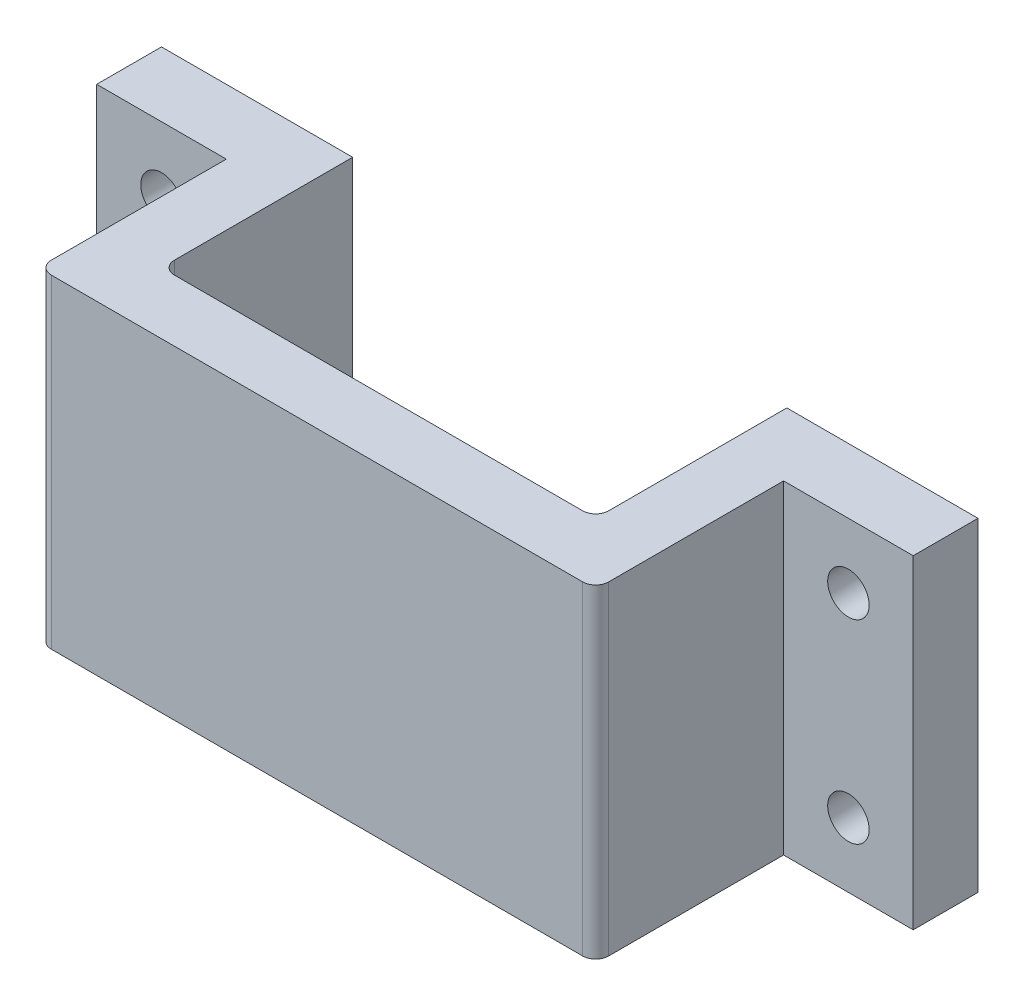
ISO-10303-21;
HEADER;
FILE_DESCRIPTION(('STEP AP214'),'2;1');
FILE_NAME('part.step','',(''),(''),'','','');
FILE_SCHEMA(('AUTOMOTIVE_DESIGN { 1 0 10303 214 1 1 1 1 }'));
ENDSEC;
DATA;
#1=APPLICATION_CONTEXT('core data for automotive mechanical design processes');
#2=APPLICATION_PROTOCOL_DEFINITION('international standard','automotive_design',2000,#1);
#3=PRODUCT_CONTEXT('',#1,'mechanical');
#4=PRODUCT('Part','Part','',(#3));
#5=PRODUCT_RELATED_PRODUCT_CATEGORY('part','',(#4));
#6=PRODUCT_DEFINITION_FORMATION('','',#4);
#7=PRODUCT_DEFINITION_CONTEXT('part definition',#1,'design');
#8=PRODUCT_DEFINITION('design','',#6,#7);
#9=PRODUCT_DEFINITION_SHAPE('','',#8);
#10=(LENGTH_UNIT() NAMED_UNIT(*) SI_UNIT(.MILLI.,.METRE.));
#11=(NAMED_UNIT(*) PLANE_ANGLE_UNIT() SI_UNIT($,.RADIAN.));
#12=(NAMED_UNIT(*) SI_UNIT($,.STERADIAN.) SOLID_ANGLE_UNIT());
#13=UNCERTAINTY_MEASURE_WITH_UNIT(LENGTH_MEASURE(1.E-05),#10,'distance_accuracy_value','');
#14=(GEOMETRIC_REPRESENTATION_CONTEXT(3) GLOBAL_UNCERTAINTY_ASSIGNED_CONTEXT((#13)) GLOBAL_UNIT_ASSIGNED_CONTEXT((#10,
#11,#12)) REPRESENTATION_CONTEXT('',''));
#15=CARTESIAN_POINT('',(0.,0.,0.));
#16=DIRECTION('',(0.,0.,1.));
#17=DIRECTION('',(1.,0.,0.));
#18=AXIS2_PLACEMENT_3D('',#15,#16,#17);
#19=CARTESIAN_POINT('',(0.,25.,0.));
#20=DIRECTION('',(1.,0.,0.));
#21=DIRECTION('',(0.,0.,-1.));
#22=AXIS2_PLACEMENT_3D('',#19,#20,#21);
#23=PLANE('',#22);
#24=DIRECTION('',(0.,0.,1.));
#25=VECTOR('',#24,1.);
#26=CARTESIAN_POINT('',(0.,0.,0.));
#27=LINE('',#26,#25);
#28=CARTESIAN_POINT('',(0.,0.,-14.5));
#29=VERTEX_POINT('',#28);
#30=CARTESIAN_POINT('',(0.,0.,-1.));
#31=VERTEX_POINT('',#30);
#32=EDGE_CURVE('E177',#29,#31,#27,.T.);
#33=ORIENTED_EDGE('',*,*,#32,.T.);
#34=DIRECTION('',(0.,-1.,0.));
#35=VECTOR('',#34,1.);
#36=CARTESIAN_POINT('',(0.,25.,-1.));
#37=LINE('',#36,#35);
#38=CARTESIAN_POINT('',(0.,25.,-1.));
#39=VERTEX_POINT('',#38);
#40=EDGE_CURVE('E58',#31,#39,#37,.F.);
#41=ORIENTED_EDGE('',*,*,#40,.T.);
#42=DIRECTION('',(0.,0.,1.));
#43=VECTOR('',#42,1.);
#44=CARTESIAN_POINT('',(0.,25.,0.));
#45=LINE('',#44,#43);
#46=CARTESIAN_POINT('',(0.,25.,-14.5));
#47=VERTEX_POINT('',#46);
#48=EDGE_CURVE('E162',#47,#39,#45,.T.);
#49=ORIENTED_EDGE('',*,*,#48,.F.);
#50=DIRECTION('',(0.,-1.,0.));
#51=VECTOR('',#50,1.);
#52=CARTESIAN_POINT('',(0.,25.,-14.5));
#53=LINE('',#52,#51);
#54=EDGE_CURVE('E151',#47,#29,#53,.T.);
#55=ORIENTED_EDGE('',*,*,#54,.T.);
#56=EDGE_LOOP('',(#33,#41,#49,#55));
#57=FACE_BOUND('',#56,.T.);
#58=ADVANCED_FACE('F35',(#57),#23,.F.);
#59=CARTESIAN_POINT('',(0.,25.,0.));
#60=DIRECTION('',(0.,0.,-1.));
#61=DIRECTION('',(-1.,0.,0.));
#62=AXIS2_PLACEMENT_3D('',#59,#60,#61);
#63=PLANE('',#62);
#64=DIRECTION('',(1.,0.,0.));
#65=VECTOR('',#64,1.);
#66=CARTESIAN_POINT('',(0.,25.,0.));
#67=LINE('',#66,#65);
#68=CARTESIAN_POINT('',(1.,25.,0.));
#69=VERTEX_POINT('',#68);
#70=CARTESIAN_POINT('',(42.,25.,0.));
#71=VERTEX_POINT('',#70);
#72=EDGE_CURVE('E168',#69,#71,#67,.T.);
#73=ORIENTED_EDGE('',*,*,#72,.F.);
#74=DIRECTION('',(0.,-1.,0.));
#75=VECTOR('',#74,1.);
#76=CARTESIAN_POINT('',(1.,25.,0.));
#77=LINE('',#76,#75);
#78=CARTESIAN_POINT('',(1.,0.,0.));
#79=VERTEX_POINT('',#78);
#80=EDGE_CURVE('E202',#69,#79,#77,.T.);
#81=ORIENTED_EDGE('',*,*,#80,.T.);
#82=DIRECTION('',(1.,0.,0.));
#83=VECTOR('',#82,1.);
#84=CARTESIAN_POINT('',(0.,0.,0.));
#85=LINE('',#84,#83);
#86=CARTESIAN_POINT('',(42.,0.,0.));
#87=VERTEX_POINT('',#86);
#88=EDGE_CURVE('E218',#79,#87,#85,.T.);
#89=ORIENTED_EDGE('',*,*,#88,.T.);
#90=DIRECTION('',(0.,-1.,0.));
#91=VECTOR('',#90,1.);
#92=CARTESIAN_POINT('',(42.,25.,0.));
#93=LINE('',#92,#91);
#94=EDGE_CURVE('E205',#87,#71,#93,.F.);
#95=ORIENTED_EDGE('',*,*,#94,.T.);
#96=EDGE_LOOP('',(#73,#81,#89,#95));
#97=FACE_BOUND('',#96,.T.);
#98=ADVANCED_FACE('F200',(#97),#63,.F.);
#99=CARTESIAN_POINT('',(43.,25.,0.));
#100=DIRECTION('',(-1.,0.,0.));
#101=DIRECTION('',(0.,0.,1.));
#102=AXIS2_PLACEMENT_3D('',#99,#100,#101);
#103=PLANE('',#102);
#104=DIRECTION('',(0.,0.,-1.));
#105=VECTOR('',#104,1.);
#106=CARTESIAN_POINT('',(43.,25.,0.));
#107=LINE('',#106,#105);
#108=CARTESIAN_POINT('',(43.,25.,-1.00000000000001));
#109=VERTEX_POINT('',#108);
#110=CARTESIAN_POINT('',(43.,25.,-14.5));
#111=VERTEX_POINT('',#110);
#112=EDGE_CURVE('E171',#109,#111,#107,.T.);
#113=ORIENTED_EDGE('',*,*,#112,.F.);
#114=DIRECTION('',(0.,-1.,0.));
#115=VECTOR('',#114,1.);
#116=CARTESIAN_POINT('',(43.,25.,-1.00000000000001));
#117=LINE('',#116,#115);
#118=CARTESIAN_POINT('',(43.,0.,-1.00000000000001));
#119=VERTEX_POINT('',#118);
#120=EDGE_CURVE('E11',#109,#119,#117,.T.);
#121=ORIENTED_EDGE('',*,*,#120,.T.);
#122=DIRECTION('',(0.,0.,-1.));
#123=VECTOR('',#122,1.);
#124=CARTESIAN_POINT('',(43.,0.,0.));
#125=LINE('',#124,#123);
#126=CARTESIAN_POINT('',(43.,0.,-14.5));
#127=VERTEX_POINT('',#126);
#128=EDGE_CURVE('E215',#119,#127,#125,.T.);
#129=ORIENTED_EDGE('',*,*,#128,.T.);
#130=DIRECTION('',(0.,1.,0.));
#131=VECTOR('',#130,1.);
#132=CARTESIAN_POINT('',(43.,25.,-14.5));
#133=LINE('',#132,#131);
#134=EDGE_CURVE('E238',#127,#111,#133,.T.);
#135=ORIENTED_EDGE('',*,*,#134,.T.);
#136=EDGE_LOOP('',(#113,#121,#129,#135));
#137=FACE_BOUND('',#136,.T.);
#138=ADVANCED_FACE('F365',(#137),#103,.F.);
#139=CARTESIAN_POINT('',(43.,25.,-19.5));
#140=DIRECTION('',(0.,0.,1.));
#141=DIRECTION('',(1.,0.,0.));
#142=AXIS2_PLACEMENT_3D('',#139,#140,#141);
#143=PLANE('',#142);
#144=CARTESIAN_POINT('',(48.,5.00000000000001,-19.4999999999999));
#145=DIRECTION('',(0.,0.,-1.));
#146=DIRECTION('',(-1.,0.,0.));
#147=AXIS2_PLACEMENT_3D('',#144,#145,#146);
#148=CIRCLE('',#147,1.60000000000005);
#149=CARTESIAN_POINT('',(46.3999999999999,5.00000000000001,-19.4999999999999));
#150=VERTEX_POINT('',#149);
#151=EDGE_CURVE('E327',#150,#150,#148,.T.);
#152=ORIENTED_EDGE('',*,*,#151,.F.);
#153=EDGE_LOOP('',(#152));
#154=FACE_BOUND('',#153,.T.);
#155=CARTESIAN_POINT('',(48.,20.,-19.4999999999999));
#156=DIRECTION('',(0.,0.,-1.));
#157=DIRECTION('',(-1.,0.,0.));
#158=AXIS2_PLACEMENT_3D('',#155,#156,#157);
#159=CIRCLE('',#158,1.60000000000005);
#160=CARTESIAN_POINT('',(46.3999999999999,20.,-19.4999999999999));
#161=VERTEX_POINT('',#160);
#162=EDGE_CURVE('E324',#161,#161,#159,.T.);
#163=ORIENTED_EDGE('',*,*,#162,.F.);
#164=EDGE_LOOP('',(#163));
#165=FACE_BOUND('',#164,.T.);
#166=DIRECTION('',(-1.,0.,0.));
#167=VECTOR('',#166,1.);
#168=CARTESIAN_POINT('',(43.,0.,-19.5));
#169=LINE('',#168,#167);
#170=CARTESIAN_POINT('',(53.,0.,-19.5));
#171=VERTEX_POINT('',#170);
#172=CARTESIAN_POINT('',(38.25,0.,-19.5));
#173=VERTEX_POINT('',#172);
#174=EDGE_CURVE('E217',#171,#173,#169,.T.);
#175=ORIENTED_EDGE('',*,*,#174,.T.);
#176=DIRECTION('',(0.,-1.,0.));
#177=VECTOR('',#176,1.);
#178=CARTESIAN_POINT('',(38.25,25.,-19.5));
#179=LINE('',#178,#177);
#180=CARTESIAN_POINT('',(38.25,25.,-19.5));
#181=VERTEX_POINT('',#180);
#182=EDGE_CURVE('E233',#181,#173,#179,.T.);
#183=ORIENTED_EDGE('',*,*,#182,.F.);
#184=DIRECTION('',(-1.,0.,0.));
#185=VECTOR('',#184,1.);
#186=CARTESIAN_POINT('',(43.,25.,-19.5));
#187=LINE('',#186,#185);
#188=CARTESIAN_POINT('',(53.,25.,-19.5));
#189=VERTEX_POINT('',#188);
#190=EDGE_CURVE('E189',#189,#181,#187,.T.);
#191=ORIENTED_EDGE('',*,*,#190,.F.);
#192=DIRECTION('',(0.,-1.,0.));
#193=VECTOR('',#192,1.);
#194=CARTESIAN_POINT('',(53.,25.,-19.5));
#195=LINE('',#194,#193);
#196=EDGE_CURVE('E250',#189,#171,#195,.T.);
#197=ORIENTED_EDGE('',*,*,#196,.T.);
#198=EDGE_LOOP('',(#175,#183,#191,#197));
#199=FACE_BOUND('',#198,.T.);
#200=ADVANCED_FACE('F265',(#154,#165,#199),#143,.F.);
#201=CARTESIAN_POINT('',(38.25,25.,-19.5));
#202=DIRECTION('',(1.,0.,0.));
#203=DIRECTION('',(0.,0.,-1.));
#204=AXIS2_PLACEMENT_3D('',#201,#202,#203);
#205=PLANE('',#204);
#206=DIRECTION('',(0.,0.,1.));
#207=VECTOR('',#206,1.);
#208=CARTESIAN_POINT('',(38.25,0.,-19.5));
#209=LINE('',#208,#207);
#210=CARTESIAN_POINT('',(38.25,0.,-5.75000000000001));
#211=VERTEX_POINT('',#210);
#212=EDGE_CURVE('E223',#173,#211,#209,.T.);
#213=ORIENTED_EDGE('',*,*,#212,.T.);
#214=DIRECTION('',(0.,-1.,0.));
#215=VECTOR('',#214,1.);
#216=CARTESIAN_POINT('',(38.25,25.,-5.75000000000001));
#217=LINE('',#216,#215);
#218=CARTESIAN_POINT('',(38.25,25.,-5.75000000000001));
#219=VERTEX_POINT('',#218);
#220=EDGE_CURVE('E306',#211,#219,#217,.F.);
#221=ORIENTED_EDGE('',*,*,#220,.T.);
#222=DIRECTION('',(0.,0.,1.));
#223=VECTOR('',#222,1.);
#224=CARTESIAN_POINT('',(38.25,25.,-19.5));
#225=LINE('',#224,#223);
#226=EDGE_CURVE('E267',#181,#219,#225,.T.);
#227=ORIENTED_EDGE('',*,*,#226,.F.);
#228=ORIENTED_EDGE('',*,*,#182,.T.);
#229=EDGE_LOOP('',(#213,#221,#227,#228));
#230=FACE_BOUND('',#229,.T.);
#231=ADVANCED_FACE('F425',(#230),#205,.F.);
#232=CARTESIAN_POINT('',(4.75,25.,-4.75));
#233=DIRECTION('',(0.,0.,1.));
#234=DIRECTION('',(1.,0.,0.));
#235=AXIS2_PLACEMENT_3D('',#232,#233,#234);
#236=PLANE('',#235);
#237=DIRECTION('',(-1.,0.,0.));
#238=VECTOR('',#237,1.);
#239=CARTESIAN_POINT('',(4.75,25.,-4.75));
#240=LINE('',#239,#238);
#241=CARTESIAN_POINT('',(37.25,25.,-4.75000000000001));
#242=VERTEX_POINT('',#241);
#243=CARTESIAN_POINT('',(5.75,25.,-4.75));
#244=VERTEX_POINT('',#243);
#245=EDGE_CURVE('E268',#242,#244,#240,.T.);
#246=ORIENTED_EDGE('',*,*,#245,.F.);
#247=DIRECTION('',(0.,-1.,0.));
#248=VECTOR('',#247,1.);
#249=CARTESIAN_POINT('',(37.25,0.,-4.75000000000001));
#250=LINE('',#249,#248);
#251=CARTESIAN_POINT('',(37.25,0.,-4.75000000000001));
#252=VERTEX_POINT('',#251);
#253=EDGE_CURVE('E303',#242,#252,#250,.T.);
#254=ORIENTED_EDGE('',*,*,#253,.T.);
#255=DIRECTION('',(-1.,0.,0.));
#256=VECTOR('',#255,1.);
#257=CARTESIAN_POINT('',(4.75,0.,-4.75));
#258=LINE('',#257,#256);
#259=CARTESIAN_POINT('',(5.75,0.,-4.75));
#260=VERTEX_POINT('',#259);
#261=EDGE_CURVE('E226',#252,#260,#258,.T.);
#262=ORIENTED_EDGE('',*,*,#261,.T.);
#263=DIRECTION('',(0.,-1.,0.));
#264=VECTOR('',#263,1.);
#265=CARTESIAN_POINT('',(5.75,25.,-4.75));
#266=LINE('',#265,#264);
#267=EDGE_CURVE('E237',#260,#244,#266,.F.);
#268=ORIENTED_EDGE('',*,*,#267,.T.);
#269=EDGE_LOOP('',(#246,#254,#262,#268));
#270=FACE_BOUND('',#269,.T.);
#271=ADVANCED_FACE('F355',(#270),#236,.F.);
#272=CARTESIAN_POINT('',(4.74999999999999,25.,-19.5));
#273=DIRECTION('',(-1.,0.,0.));
#274=DIRECTION('',(0.,0.,1.));
#275=AXIS2_PLACEMENT_3D('',#272,#273,#274);
#276=PLANE('',#275);
#277=DIRECTION('',(0.,0.,-1.));
#278=VECTOR('',#277,1.);
#279=CARTESIAN_POINT('',(4.74999999999999,25.,-19.5));
#280=LINE('',#279,#278);
#281=CARTESIAN_POINT('',(4.75,25.,-5.75));
#282=VERTEX_POINT('',#281);
#283=CARTESIAN_POINT('',(4.74999999999999,25.,-19.5));
#284=VERTEX_POINT('',#283);
#285=EDGE_CURVE('E271',#282,#284,#280,.T.);
#286=ORIENTED_EDGE('',*,*,#285,.F.);
#287=DIRECTION('',(0.,-1.,0.));
#288=VECTOR('',#287,1.);
#289=CARTESIAN_POINT('',(4.75,0.,-5.75));
#290=LINE('',#289,#288);
#291=CARTESIAN_POINT('',(4.75,0.,-5.75));
#292=VERTEX_POINT('',#291);
#293=EDGE_CURVE('E308',#282,#292,#290,.T.);
#294=ORIENTED_EDGE('',*,*,#293,.T.);
#295=DIRECTION('',(0.,0.,-1.));
#296=VECTOR('',#295,1.);
#297=CARTESIAN_POINT('',(4.74999999999999,0.,-19.5));
#298=LINE('',#297,#296);
#299=CARTESIAN_POINT('',(4.74999999999999,0.,-19.5));
#300=VERTEX_POINT('',#299);
#301=EDGE_CURVE('E173',#292,#300,#298,.T.);
#302=ORIENTED_EDGE('',*,*,#301,.T.);
#303=DIRECTION('',(0.,-1.,0.));
#304=VECTOR('',#303,1.);
#305=CARTESIAN_POINT('',(4.74999999999999,25.,-19.5));
#306=LINE('',#305,#304);
#307=EDGE_CURVE('E230',#284,#300,#306,.T.);
#308=ORIENTED_EDGE('',*,*,#307,.F.);
#309=EDGE_LOOP('',(#286,#294,#302,#308));
#310=FACE_BOUND('',#309,.T.);
#311=ADVANCED_FACE('F346',(#310),#276,.F.);
#312=CARTESIAN_POINT('',(4.74999999999999,25.,-19.5));
#313=DIRECTION('',(0.,0.,1.));
#314=DIRECTION('',(1.,0.,0.));
#315=AXIS2_PLACEMENT_3D('',#312,#313,#314);
#316=PLANE('',#315);
#317=CARTESIAN_POINT('',(-5.00000000000003,5.00000000000001,-19.5));
#318=DIRECTION('',(0.,0.,-1.));
#319=DIRECTION('',(-1.,0.,0.));
#320=AXIS2_PLACEMENT_3D('',#317,#318,#319);
#321=CIRCLE('',#320,1.60000000000003);
#322=CARTESIAN_POINT('',(-6.60000000000006,5.00000000000001,-19.5));
#323=VERTEX_POINT('',#322);
#324=EDGE_CURVE('E321',#323,#323,#321,.T.);
#325=ORIENTED_EDGE('',*,*,#324,.F.);
#326=EDGE_LOOP('',(#325));
#327=FACE_BOUND('',#326,.T.);
#328=CARTESIAN_POINT('',(-5.00000000000002,20.,-19.5));
#329=DIRECTION('',(0.,0.,-1.));
#330=DIRECTION('',(-1.,0.,0.));
#331=AXIS2_PLACEMENT_3D('',#328,#329,#330);
#332=CIRCLE('',#331,1.60000000000003);
#333=CARTESIAN_POINT('',(-6.60000000000006,20.,-19.5));
#334=VERTEX_POINT('',#333);
#335=EDGE_CURVE('E293',#334,#334,#332,.T.);
#336=ORIENTED_EDGE('',*,*,#335,.F.);
#337=EDGE_LOOP('',(#336));
#338=FACE_BOUND('',#337,.T.);
#339=DIRECTION('',(-1.,0.,0.));
#340=VECTOR('',#339,1.);
#341=CARTESIAN_POINT('',(4.74999999999999,0.,-19.5));
#342=LINE('',#341,#340);
#343=CARTESIAN_POINT('',(-10.,0.,-19.5));
#344=VERTEX_POINT('',#343);
#345=EDGE_CURVE('E169',#300,#344,#342,.T.);
#346=ORIENTED_EDGE('',*,*,#345,.T.);
#347=DIRECTION('',(0.,1.,0.));
#348=VECTOR('',#347,1.);
#349=CARTESIAN_POINT('',(-10.,25.,-19.5));
#350=LINE('',#349,#348);
#351=CARTESIAN_POINT('',(-10.,25.,-19.5));
#352=VERTEX_POINT('',#351);
#353=EDGE_CURVE('E166',#344,#352,#350,.T.);
#354=ORIENTED_EDGE('',*,*,#353,.T.);
#355=DIRECTION('',(-1.,0.,0.));
#356=VECTOR('',#355,1.);
#357=CARTESIAN_POINT('',(4.74999999999999,25.,-19.5));
#358=LINE('',#357,#356);
#359=EDGE_CURVE('E234',#284,#352,#358,.T.);
#360=ORIENTED_EDGE('',*,*,#359,.F.);
#361=ORIENTED_EDGE('',*,*,#307,.T.);
#362=EDGE_LOOP('',(#346,#354,#360,#361));
#363=FACE_BOUND('',#362,.T.);
#364=ADVANCED_FACE('F287',(#327,#338,#363),#316,.F.);
#365=CARTESIAN_POINT('',(0.,25.,0.));
#366=DIRECTION('',(0.,1.,0.));
#367=DIRECTION('',(0.,0.,1.));
#368=AXIS2_PLACEMENT_3D('',#365,#366,#367);
#369=PLANE('',#368);
#370=ORIENTED_EDGE('',*,*,#48,.T.);
#371=CARTESIAN_POINT('',(1.,25.,-1.));
#372=DIRECTION('',(0.,1.,0.));
#373=DIRECTION('',(0.,0.,1.));
#374=AXIS2_PLACEMENT_3D('',#371,#372,#373);
#375=CIRCLE('',#374,1.);
#376=EDGE_CURVE('E43',#39,#69,#375,.T.);
#377=ORIENTED_EDGE('',*,*,#376,.T.);
#378=ORIENTED_EDGE('',*,*,#72,.T.);
#379=CARTESIAN_POINT('',(42.,25.,-1.00000000000001));
#380=DIRECTION('',(0.,1.,0.));
#381=DIRECTION('',(0.,0.,1.));
#382=AXIS2_PLACEMENT_3D('',#379,#380,#381);
#383=CIRCLE('',#382,1.);
#384=EDGE_CURVE('E50',#71,#109,#383,.T.);
#385=ORIENTED_EDGE('',*,*,#384,.T.);
#386=ORIENTED_EDGE('',*,*,#112,.T.);
#387=DIRECTION('',(1.,0.,0.));
#388=VECTOR('',#387,1.);
#389=CARTESIAN_POINT('',(43.,25.,-14.5));
#390=LINE('',#389,#388);
#391=CARTESIAN_POINT('',(53.,25.,-14.5));
#392=VERTEX_POINT('',#391);
#393=EDGE_CURVE('E243',#111,#392,#390,.T.);
#394=ORIENTED_EDGE('',*,*,#393,.T.);
#395=DIRECTION('',(0.,0.,-1.));
#396=VECTOR('',#395,1.);
#397=CARTESIAN_POINT('',(53.,25.,-14.5));
#398=LINE('',#397,#396);
#399=EDGE_CURVE('E184',#392,#189,#398,.T.);
#400=ORIENTED_EDGE('',*,*,#399,.T.);
#401=ORIENTED_EDGE('',*,*,#190,.T.);
#402=ORIENTED_EDGE('',*,*,#226,.T.);
#403=CARTESIAN_POINT('',(37.25,25.,-5.75000000000001));
#404=DIRECTION('',(0.,1.,0.));
#405=DIRECTION('',(0.,0.,1.));
#406=AXIS2_PLACEMENT_3D('',#403,#404,#405);
#407=CIRCLE('',#406,1.);
#408=EDGE_CURVE('E313',#219,#242,#407,.F.);
#409=ORIENTED_EDGE('',*,*,#408,.T.);
#410=ORIENTED_EDGE('',*,*,#245,.T.);
#411=CARTESIAN_POINT('',(5.75,25.,-5.75));
#412=DIRECTION('',(0.,1.,0.));
#413=DIRECTION('',(0.,0.,1.));
#414=AXIS2_PLACEMENT_3D('',#411,#412,#413);
#415=CIRCLE('',#414,1.);
#416=EDGE_CURVE('E211',#244,#282,#415,.F.);
#417=ORIENTED_EDGE('',*,*,#416,.T.);
#418=ORIENTED_EDGE('',*,*,#285,.T.);
#419=ORIENTED_EDGE('',*,*,#359,.T.);
#420=DIRECTION('',(0.,0.,-1.));
#421=VECTOR('',#420,1.);
#422=CARTESIAN_POINT('',(-10.,25.,-14.5));
#423=LINE('',#422,#421);
#424=CARTESIAN_POINT('',(-10.,25.,-14.5));
#425=VERTEX_POINT('',#424);
#426=EDGE_CURVE('E165',#425,#352,#423,.T.);
#427=ORIENTED_EDGE('',*,*,#426,.F.);
#428=DIRECTION('',(1.,0.,0.));
#429=VECTOR('',#428,1.);
#430=CARTESIAN_POINT('',(0.,25.,-14.5));
#431=LINE('',#430,#429);
#432=EDGE_CURVE('E155',#425,#47,#431,.T.);
#433=ORIENTED_EDGE('',*,*,#432,.T.);
#434=EDGE_LOOP('',(#370,#377,#378,#385,#386,#394,#400,#401,#402,#409,#410,#417,#418,#419,#427,#433));
#435=FACE_BOUND('',#434,.T.);
#436=ADVANCED_FACE('F161',(#435),#369,.T.);
#437=CARTESIAN_POINT('',(0.,0.,0.));
#438=DIRECTION('',(0.,1.,0.));
#439=DIRECTION('',(0.,0.,1.));
#440=AXIS2_PLACEMENT_3D('',#437,#438,#439);
#441=PLANE('',#440);
#442=ORIENTED_EDGE('',*,*,#88,.F.);
#443=CARTESIAN_POINT('',(1.,0.,-1.));
#444=DIRECTION('',(0.,1.,0.));
#445=DIRECTION('',(0.,0.,1.));
#446=AXIS2_PLACEMENT_3D('',#443,#444,#445);
#447=CIRCLE('',#446,1.);
#448=EDGE_CURVE('E207',#79,#31,#447,.F.);
#449=ORIENTED_EDGE('',*,*,#448,.T.);
#450=ORIENTED_EDGE('',*,*,#32,.F.);
#451=DIRECTION('',(-1.,0.,0.));
#452=VECTOR('',#451,1.);
#453=CARTESIAN_POINT('',(0.,0.,-14.5));
#454=LINE('',#453,#452);
#455=CARTESIAN_POINT('',(-10.,0.,-14.5));
#456=VERTEX_POINT('',#455);
#457=EDGE_CURVE('E158',#29,#456,#454,.T.);
#458=ORIENTED_EDGE('',*,*,#457,.T.);
#459=DIRECTION('',(0.,0.,-1.));
#460=VECTOR('',#459,1.);
#461=CARTESIAN_POINT('',(-10.,0.,-14.5));
#462=LINE('',#461,#460);
#463=EDGE_CURVE('E285',#456,#344,#462,.T.);
#464=ORIENTED_EDGE('',*,*,#463,.T.);
#465=ORIENTED_EDGE('',*,*,#345,.F.);
#466=ORIENTED_EDGE('',*,*,#301,.F.);
#467=CARTESIAN_POINT('',(5.75,0.,-5.75));
#468=DIRECTION('',(0.,1.,0.));
#469=DIRECTION('',(0.,0.,1.));
#470=AXIS2_PLACEMENT_3D('',#467,#468,#469);
#471=CIRCLE('',#470,1.);
#472=EDGE_CURVE('E315',#292,#260,#471,.T.);
#473=ORIENTED_EDGE('',*,*,#472,.T.);
#474=ORIENTED_EDGE('',*,*,#261,.F.);
#475=CARTESIAN_POINT('',(37.25,0.,-5.75000000000001));
#476=DIRECTION('',(0.,1.,0.));
#477=DIRECTION('',(0.,0.,1.));
#478=AXIS2_PLACEMENT_3D('',#475,#476,#477);
#479=CIRCLE('',#478,1.);
#480=EDGE_CURVE('E311',#252,#211,#479,.T.);
#481=ORIENTED_EDGE('',*,*,#480,.T.);
#482=ORIENTED_EDGE('',*,*,#212,.F.);
#483=ORIENTED_EDGE('',*,*,#174,.F.);
#484=DIRECTION('',(0.,0.,-1.));
#485=VECTOR('',#484,1.);
#486=CARTESIAN_POINT('',(53.,0.,-14.5));
#487=LINE('',#486,#485);
#488=CARTESIAN_POINT('',(53.,0.,-14.5));
#489=VERTEX_POINT('',#488);
#490=EDGE_CURVE('E252',#489,#171,#487,.T.);
#491=ORIENTED_EDGE('',*,*,#490,.F.);
#492=DIRECTION('',(-1.,0.,0.));
#493=VECTOR('',#492,1.);
#494=CARTESIAN_POINT('',(43.,0.,-14.5));
#495=LINE('',#494,#493);
#496=EDGE_CURVE('E242',#489,#127,#495,.T.);
#497=ORIENTED_EDGE('',*,*,#496,.T.);
#498=ORIENTED_EDGE('',*,*,#128,.F.);
#499=CARTESIAN_POINT('',(42.,0.,-1.00000000000001));
#500=DIRECTION('',(0.,1.,0.));
#501=DIRECTION('',(0.,0.,1.));
#502=AXIS2_PLACEMENT_3D('',#499,#500,#501);
#503=CIRCLE('',#502,1.);
#504=EDGE_CURVE('E208',#119,#87,#503,.F.);
#505=ORIENTED_EDGE('',*,*,#504,.T.);
#506=EDGE_LOOP('',(#442,#449,#450,#458,#464,#465,#466,#473,#474,#481,#482,#483,#491,#497,#498,#505));
#507=FACE_BOUND('',#506,.T.);
#508=ADVANCED_FACE('F353',(#507),#441,.F.);
#509=CARTESIAN_POINT('',(53.,25.,-14.5));
#510=DIRECTION('',(1.,0.,0.));
#511=DIRECTION('',(0.,0.,-1.));
#512=AXIS2_PLACEMENT_3D('',#509,#510,#511);
#513=PLANE('',#512);
#514=ORIENTED_EDGE('',*,*,#196,.F.);
#515=ORIENTED_EDGE('',*,*,#399,.F.);
#516=DIRECTION('',(0.,-1.,0.));
#517=VECTOR('',#516,1.);
#518=CARTESIAN_POINT('',(53.,25.,-14.5));
#519=LINE('',#518,#517);
#520=EDGE_CURVE('E248',#392,#489,#519,.T.);
#521=ORIENTED_EDGE('',*,*,#520,.T.);
#522=ORIENTED_EDGE('',*,*,#490,.T.);
#523=EDGE_LOOP('',(#514,#515,#521,#522));
#524=FACE_BOUND('',#523,.T.);
#525=ADVANCED_FACE('F263',(#524),#513,.T.);
#526=CARTESIAN_POINT('',(0.,0.,-14.5));
#527=DIRECTION('',(0.,0.,-1.));
#528=DIRECTION('',(-1.,0.,0.));
#529=AXIS2_PLACEMENT_3D('',#526,#527,#528);
#530=PLANE('',#529);
#531=CARTESIAN_POINT('',(48.,5.00000000000001,-14.5));
#532=DIRECTION('',(0.,0.,-1.));
#533=DIRECTION('',(-1.,0.,0.));
#534=AXIS2_PLACEMENT_3D('',#531,#532,#533);
#535=CIRCLE('',#534,1.60000000000005);
#536=CARTESIAN_POINT('',(46.3999999999999,5.00000000000001,-14.5));
#537=VERTEX_POINT('',#536);
#538=EDGE_CURVE('E325',#537,#537,#535,.T.);
#539=ORIENTED_EDGE('',*,*,#538,.T.);
#540=EDGE_LOOP('',(#539));
#541=FACE_BOUND('',#540,.T.);
#542=CARTESIAN_POINT('',(48.,20.,-14.5));
#543=DIRECTION('',(0.,0.,-1.));
#544=DIRECTION('',(-1.,0.,0.));
#545=AXIS2_PLACEMENT_3D('',#542,#543,#544);
#546=CIRCLE('',#545,1.60000000000005);
#547=CARTESIAN_POINT('',(46.3999999999999,20.,-14.5));
#548=VERTEX_POINT('',#547);
#549=EDGE_CURVE('E322',#548,#548,#546,.T.);
#550=ORIENTED_EDGE('',*,*,#549,.T.);
#551=EDGE_LOOP('',(#550));
#552=FACE_BOUND('',#551,.T.);
#553=ORIENTED_EDGE('',*,*,#393,.F.);
#554=ORIENTED_EDGE('',*,*,#134,.F.);
#555=ORIENTED_EDGE('',*,*,#496,.F.);
#556=ORIENTED_EDGE('',*,*,#520,.F.);
#557=EDGE_LOOP('',(#553,#554,#555,#556));
#558=FACE_BOUND('',#557,.T.);
#559=ADVANCED_FACE('F404',(#541,#552,#558),#530,.F.);
#560=CARTESIAN_POINT('',(-10.,25.,-14.5));
#561=DIRECTION('',(-1.,0.,0.));
#562=DIRECTION('',(0.,0.,1.));
#563=AXIS2_PLACEMENT_3D('',#560,#561,#562);
#564=PLANE('',#563);
#565=ORIENTED_EDGE('',*,*,#353,.F.);
#566=ORIENTED_EDGE('',*,*,#463,.F.);
#567=DIRECTION('',(0.,1.,0.));
#568=VECTOR('',#567,1.);
#569=CARTESIAN_POINT('',(-10.,25.,-14.5));
#570=LINE('',#569,#568);
#571=EDGE_CURVE('E284',#456,#425,#570,.T.);
#572=ORIENTED_EDGE('',*,*,#571,.T.);
#573=ORIENTED_EDGE('',*,*,#426,.T.);
#574=EDGE_LOOP('',(#565,#566,#572,#573));
#575=FACE_BOUND('',#574,.T.);
#576=ADVANCED_FACE('F283',(#575),#564,.T.);
#577=CARTESIAN_POINT('',(0.,0.,-14.5));
#578=DIRECTION('',(0.,0.,1.));
#579=DIRECTION('',(1.,0.,0.));
#580=AXIS2_PLACEMENT_3D('',#577,#578,#579);
#581=PLANE('',#580);
#582=CARTESIAN_POINT('',(-5.00000000000004,5.00000000000001,-14.5));
#583=DIRECTION('',(0.,0.,1.));
#584=DIRECTION('',(1.,0.,0.));
#585=AXIS2_PLACEMENT_3D('',#582,#583,#584);
#586=CIRCLE('',#585,1.60000000000003);
#587=CARTESIAN_POINT('',(-3.40000000000001,5.00000000000001,-14.5));
#588=VERTEX_POINT('',#587);
#589=EDGE_CURVE('E318',#588,#588,#586,.T.);
#590=ORIENTED_EDGE('',*,*,#589,.F.);
#591=EDGE_LOOP('',(#590));
#592=FACE_BOUND('',#591,.T.);
#593=CARTESIAN_POINT('',(-5.00000000000003,20.,-14.5));
#594=DIRECTION('',(0.,0.,1.));
#595=DIRECTION('',(1.,0.,0.));
#596=AXIS2_PLACEMENT_3D('',#593,#594,#595);
#597=CIRCLE('',#596,1.60000000000003);
#598=CARTESIAN_POINT('',(-3.4,20.,-14.5));
#599=VERTEX_POINT('',#598);
#600=EDGE_CURVE('E290',#599,#599,#597,.T.);
#601=ORIENTED_EDGE('',*,*,#600,.F.);
#602=EDGE_LOOP('',(#601));
#603=FACE_BOUND('',#602,.T.);
#604=ORIENTED_EDGE('',*,*,#432,.F.);
#605=ORIENTED_EDGE('',*,*,#571,.F.);
#606=ORIENTED_EDGE('',*,*,#457,.F.);
#607=ORIENTED_EDGE('',*,*,#54,.F.);
#608=EDGE_LOOP('',(#604,#605,#606,#607));
#609=FACE_BOUND('',#608,.T.);
#610=ADVANCED_FACE('F153',(#592,#603,#609),#581,.T.);
#611=CARTESIAN_POINT('',(37.25,25.,-5.75000000000001));
#612=DIRECTION('',(0.,1.,0.));
#613=DIRECTION('',(0.,0.,1.));
#614=AXIS2_PLACEMENT_3D('',#611,#612,#613);
#615=CYLINDRICAL_SURFACE('',#614,1.);
#616=ORIENTED_EDGE('',*,*,#408,.F.);
#617=ORIENTED_EDGE('',*,*,#220,.F.);
#618=ORIENTED_EDGE('',*,*,#480,.F.);
#619=ORIENTED_EDGE('',*,*,#253,.F.);
#620=EDGE_LOOP('',(#616,#617,#618,#619));
#621=FACE_BOUND('',#620,.T.);
#622=ADVANCED_FACE('F369',(#621),#615,.F.);
#623=CARTESIAN_POINT('',(5.75,25.,-5.75));
#624=DIRECTION('',(0.,1.,0.));
#625=DIRECTION('',(0.,0.,1.));
#626=AXIS2_PLACEMENT_3D('',#623,#624,#625);
#627=CYLINDRICAL_SURFACE('',#626,1.);
#628=ORIENTED_EDGE('',*,*,#416,.F.);
#629=ORIENTED_EDGE('',*,*,#267,.F.);
#630=ORIENTED_EDGE('',*,*,#472,.F.);
#631=ORIENTED_EDGE('',*,*,#293,.F.);
#632=EDGE_LOOP('',(#628,#629,#630,#631));
#633=FACE_BOUND('',#632,.T.);
#634=ADVANCED_FACE('F372',(#633),#627,.F.);
#635=CARTESIAN_POINT('',(-5.00000000000005,20.,2.50000000076578E-05));
#636=DIRECTION('',(0.,0.,-1.));
#637=DIRECTION('',(-1.,0.,0.));
#638=AXIS2_PLACEMENT_3D('',#635,#636,#637);
#639=CYLINDRICAL_SURFACE('',#638,1.60000000000003);
#640=ORIENTED_EDGE('',*,*,#600,.T.);
#641=EDGE_LOOP('',(#640));
#642=FACE_BOUND('',#641,.T.);
#643=ORIENTED_EDGE('',*,*,#335,.T.);
#644=EDGE_LOOP('',(#643));
#645=FACE_BOUND('',#644,.T.);
#646=ADVANCED_FACE('F343',(#642,#645),#639,.F.);
#647=CARTESIAN_POINT('',(-5.00000000000006,5.00000000000001,2.50000000076578E-05));
#648=DIRECTION('',(0.,0.,-1.));
#649=DIRECTION('',(-1.,0.,0.));
#650=AXIS2_PLACEMENT_3D('',#647,#648,#649);
#651=CYLINDRICAL_SURFACE('',#650,1.60000000000003);
#652=ORIENTED_EDGE('',*,*,#589,.T.);
#653=EDGE_LOOP('',(#652));
#654=FACE_BOUND('',#653,.T.);
#655=ORIENTED_EDGE('',*,*,#324,.T.);
#656=EDGE_LOOP('',(#655));
#657=FACE_BOUND('',#656,.T.);
#658=ADVANCED_FACE('F388',(#654,#657),#651,.F.);
#659=CARTESIAN_POINT('',(48.,20.,2.50000000839856E-05));
#660=DIRECTION('',(0.,0.,-1.));
#661=DIRECTION('',(-1.,0.,0.));
#662=AXIS2_PLACEMENT_3D('',#659,#660,#661);
#663=CYLINDRICAL_SURFACE('',#662,1.60000000000005);
#664=ORIENTED_EDGE('',*,*,#162,.T.);
#665=EDGE_LOOP('',(#664));
#666=FACE_BOUND('',#665,.T.);
#667=ORIENTED_EDGE('',*,*,#549,.F.);
#668=EDGE_LOOP('',(#667));
#669=FACE_BOUND('',#668,.T.);
#670=ADVANCED_FACE('F383',(#666,#669),#663,.F.);
#671=CARTESIAN_POINT('',(48.,5.00000000000001,2.50000000839856E-05));
#672=DIRECTION('',(0.,0.,-1.));
#673=DIRECTION('',(-1.,0.,0.));
#674=AXIS2_PLACEMENT_3D('',#671,#672,#673);
#675=CYLINDRICAL_SURFACE('',#674,1.60000000000005);
#676=ORIENTED_EDGE('',*,*,#151,.T.);
#677=EDGE_LOOP('',(#676));
#678=FACE_BOUND('',#677,.T.);
#679=ORIENTED_EDGE('',*,*,#538,.F.);
#680=EDGE_LOOP('',(#679));
#681=FACE_BOUND('',#680,.T.);
#682=ADVANCED_FACE('F377',(#678,#681),#675,.F.);
#683=CARTESIAN_POINT('',(1.,25.,-1.));
#684=DIRECTION('',(0.,-1.,0.));
#685=DIRECTION('',(0.,0.,-1.));
#686=AXIS2_PLACEMENT_3D('',#683,#684,#685);
#687=CYLINDRICAL_SURFACE('',#686,1.);
#688=ORIENTED_EDGE('',*,*,#376,.F.);
#689=ORIENTED_EDGE('',*,*,#40,.F.);
#690=ORIENTED_EDGE('',*,*,#448,.F.);
#691=ORIENTED_EDGE('',*,*,#80,.F.);
#692=EDGE_LOOP('',(#688,#689,#690,#691));
#693=FACE_BOUND('',#692,.T.);
#694=ADVANCED_FACE('F206',(#693),#687,.T.);
#695=CARTESIAN_POINT('',(42.,25.,-1.00000000000001));
#696=DIRECTION('',(0.,-1.,0.));
#697=DIRECTION('',(0.,0.,-1.));
#698=AXIS2_PLACEMENT_3D('',#695,#696,#697);
#699=CYLINDRICAL_SURFACE('',#698,1.);
#700=ORIENTED_EDGE('',*,*,#384,.F.);
#701=ORIENTED_EDGE('',*,*,#94,.F.);
#702=ORIENTED_EDGE('',*,*,#504,.F.);
#703=ORIENTED_EDGE('',*,*,#120,.F.);
#704=EDGE_LOOP('',(#700,#701,#702,#703));
#705=FACE_BOUND('',#704,.T.);
#706=ADVANCED_FACE('F37',(#705),#699,.T.);
#707=CLOSED_SHELL('',(#58,#98,#138,#200,#231,#271,#311,#364,#436,#508,#525,#559,#576,#610,#622,
#634,#646,#658,#670,#682,#694,#706));
#708=MANIFOLD_SOLID_BREP('B2',#707);
#709=ADVANCED_BREP_SHAPE_REPRESENTATION('',(#18,#708),#14);
#710=SHAPE_DEFINITION_REPRESENTATION(#9,#709);
ENDSEC;
END-ISO-10303-21;
